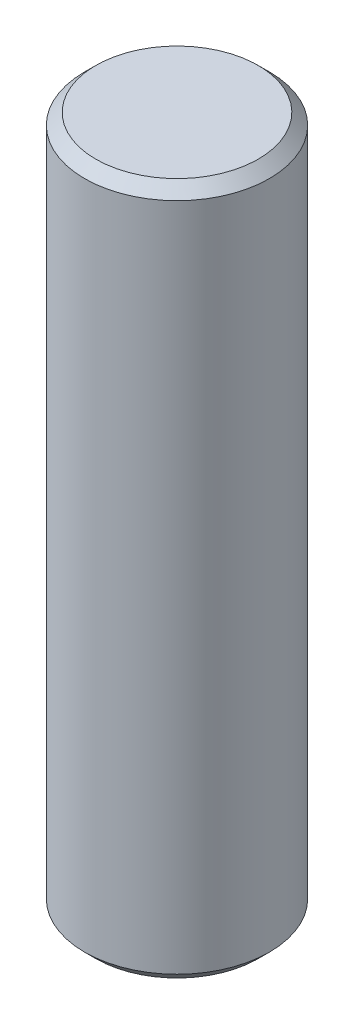
ISO-10303-21;
HEADER;
FILE_DESCRIPTION(('STEP AP214'),'2;1');
FILE_NAME('part.step','',(''),(''),'','','');
FILE_SCHEMA(('AUTOMOTIVE_DESIGN { 1 0 10303 214 1 1 1 1 }'));
ENDSEC;
DATA;
#1=APPLICATION_CONTEXT('core data for automotive mechanical design processes');
#2=APPLICATION_PROTOCOL_DEFINITION('international standard','automotive_design',2000,#1);
#3=PRODUCT_CONTEXT('',#1,'mechanical');
#4=PRODUCT('Part','Part','',(#3));
#5=PRODUCT_RELATED_PRODUCT_CATEGORY('part','',(#4));
#6=PRODUCT_DEFINITION_FORMATION('','',#4);
#7=PRODUCT_DEFINITION_CONTEXT('part definition',#1,'design');
#8=PRODUCT_DEFINITION('design','',#6,#7);
#9=PRODUCT_DEFINITION_SHAPE('','',#8);
#10=(LENGTH_UNIT() NAMED_UNIT(*) SI_UNIT(.MILLI.,.METRE.));
#11=(NAMED_UNIT(*) PLANE_ANGLE_UNIT() SI_UNIT($,.RADIAN.));
#12=(NAMED_UNIT(*) SI_UNIT($,.STERADIAN.) SOLID_ANGLE_UNIT());
#13=UNCERTAINTY_MEASURE_WITH_UNIT(LENGTH_MEASURE(1.E-05),#10,'distance_accuracy_value','');
#14=(GEOMETRIC_REPRESENTATION_CONTEXT(3) GLOBAL_UNCERTAINTY_ASSIGNED_CONTEXT((#13)) GLOBAL_UNIT_ASSIGNED_CONTEXT((#10,
#11,#12)) REPRESENTATION_CONTEXT('',''));
#15=CARTESIAN_POINT('',(0.,0.,0.));
#16=DIRECTION('',(0.,0.,1.));
#17=DIRECTION('',(1.,0.,0.));
#18=AXIS2_PLACEMENT_3D('',#15,#16,#17);
#19=CARTESIAN_POINT('',(0.,30.9,0.));
#20=DIRECTION('',(0.,-1.,0.));
#21=DIRECTION('',(0.,0.,-1.));
#22=AXIS2_PLACEMENT_3D('',#19,#20,#21);
#23=CYLINDRICAL_SURFACE('',#22,4.125);
#24=CARTESIAN_POINT('',(0.,0.500000000000004,0.));
#25=DIRECTION('',(0.,1.,0.));
#26=DIRECTION('',(0.,0.,1.));
#27=AXIS2_PLACEMENT_3D('',#24,#25,#26);
#28=CIRCLE('',#27,4.125);
#29=CARTESIAN_POINT('',(0.,0.500000000000004,4.125));
#30=VERTEX_POINT('',#29);
#31=EDGE_CURVE('E41',#30,#30,#28,.T.);
#32=ORIENTED_EDGE('',*,*,#31,.T.);
#33=EDGE_LOOP('',(#32));
#34=FACE_BOUND('',#33,.T.);
#35=CARTESIAN_POINT('',(0.,30.4,0.));
#36=DIRECTION('',(0.,1.,0.));
#37=DIRECTION('',(0.,0.,1.));
#38=AXIS2_PLACEMENT_3D('',#35,#36,#37);
#39=CIRCLE('',#38,4.125);
#40=CARTESIAN_POINT('',(0.,30.4,4.125));
#41=VERTEX_POINT('',#40);
#42=EDGE_CURVE('E45',#41,#41,#39,.F.);
#43=ORIENTED_EDGE('',*,*,#42,.T.);
#44=EDGE_LOOP('',(#43));
#45=FACE_BOUND('',#44,.T.);
#46=ADVANCED_FACE('F30',(#34,#45),#23,.T.);
#47=CARTESIAN_POINT('',(0.,30.9,0.));
#48=DIRECTION('',(0.,1.,0.));
#49=DIRECTION('',(0.,0.,1.));
#50=AXIS2_PLACEMENT_3D('',#47,#48,#49);
#51=PLANE('',#50);
#52=CARTESIAN_POINT('',(0.,30.9,0.));
#53=DIRECTION('',(0.,1.,0.));
#54=DIRECTION('',(0.,0.,1.));
#55=AXIS2_PLACEMENT_3D('',#52,#53,#54);
#56=CIRCLE('',#55,3.62500000000001);
#57=CARTESIAN_POINT('',(0.,30.9,3.62500000000001));
#58=VERTEX_POINT('',#57);
#59=EDGE_CURVE('E10',#58,#58,#56,.T.);
#60=ORIENTED_EDGE('',*,*,#59,.T.);
#61=EDGE_LOOP('',(#60));
#62=FACE_BOUND('',#61,.T.);
#63=ADVANCED_FACE('F61',(#62),#51,.T.);
#64=CARTESIAN_POINT('',(0.,0.,0.));
#65=DIRECTION('',(0.,1.,0.));
#66=DIRECTION('',(0.,0.,1.));
#67=AXIS2_PLACEMENT_3D('',#64,#65,#66);
#68=PLANE('',#67);
#69=CARTESIAN_POINT('',(0.,0.,0.));
#70=DIRECTION('',(0.,1.,0.));
#71=DIRECTION('',(0.,0.,1.));
#72=AXIS2_PLACEMENT_3D('',#69,#70,#71);
#73=CIRCLE('',#72,3.625);
#74=CARTESIAN_POINT('',(0.,0.,3.625));
#75=VERTEX_POINT('',#74);
#76=EDGE_CURVE('E37',#75,#75,#73,.F.);
#77=ORIENTED_EDGE('',*,*,#76,.T.);
#78=EDGE_LOOP('',(#77));
#79=FACE_BOUND('',#78,.T.);
#80=ADVANCED_FACE('F58',(#79),#68,.F.);
#81=CARTESIAN_POINT('',(0.,0.500000000000004,0.));
#82=DIRECTION('',(0.,1.,0.));
#83=DIRECTION('',(0.,0.,1.));
#84=AXIS2_PLACEMENT_3D('',#81,#82,#83);
#85=CONICAL_SURFACE('',#84,4.125,0.785398163397448);
#86=ORIENTED_EDGE('',*,*,#76,.F.);
#87=EDGE_LOOP('',(#86));
#88=FACE_BOUND('',#87,.T.);
#89=ORIENTED_EDGE('',*,*,#31,.F.);
#90=EDGE_LOOP('',(#89));
#91=FACE_BOUND('',#90,.T.);
#92=ADVANCED_FACE('F54',(#88,#91),#85,.T.);
#93=CARTESIAN_POINT('',(0.,30.9,0.));
#94=DIRECTION('',(0.,-1.,0.));
#95=DIRECTION('',(0.,0.,-1.));
#96=AXIS2_PLACEMENT_3D('',#93,#94,#95);
#97=CONICAL_SURFACE('',#96,3.62500000000001,0.785398163397441);
#98=ORIENTED_EDGE('',*,*,#42,.F.);
#99=EDGE_LOOP('',(#98));
#100=FACE_BOUND('',#99,.T.);
#101=ORIENTED_EDGE('',*,*,#59,.F.);
#102=EDGE_LOOP('',(#101));
#103=FACE_BOUND('',#102,.T.);
#104=ADVANCED_FACE('F32',(#100,#103),#97,.T.);
#105=CLOSED_SHELL('',(#46,#63,#80,#92,#104));
#106=MANIFOLD_SOLID_BREP('B2',#105);
#107=ADVANCED_BREP_SHAPE_REPRESENTATION('',(#18,#106),#14);
#108=SHAPE_DEFINITION_REPRESENTATION(#9,#107);
ENDSEC;
END-ISO-10303-21;
